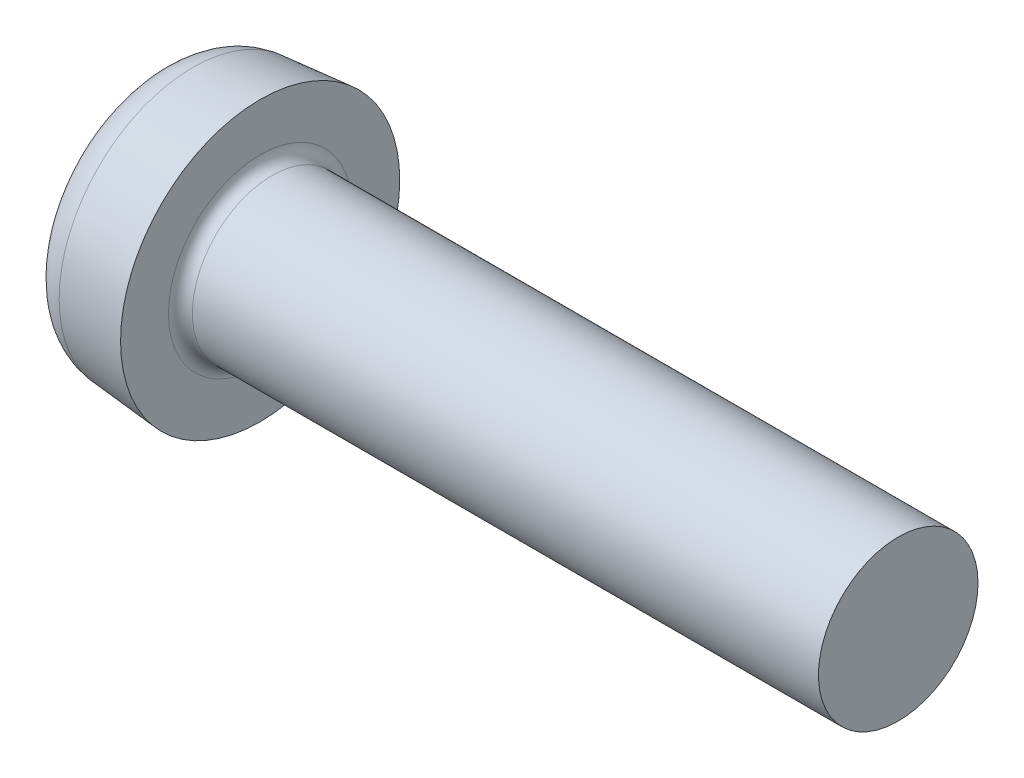
ISO-10303-21;
HEADER;
FILE_DESCRIPTION(('STEP AP214'),'2;1');
FILE_NAME('part.step','',(''),(''),'','','');
FILE_SCHEMA(('AUTOMOTIVE_DESIGN { 1 0 10303 214 1 1 1 1 }'));
ENDSEC;
DATA;
#1=APPLICATION_CONTEXT('core data for automotive mechanical design processes');
#2=APPLICATION_PROTOCOL_DEFINITION('international standard','automotive_design',2000,#1);
#3=PRODUCT_CONTEXT('',#1,'mechanical');
#4=PRODUCT('Part','Part','',(#3));
#5=PRODUCT_RELATED_PRODUCT_CATEGORY('part','',(#4));
#6=PRODUCT_DEFINITION_FORMATION('','',#4);
#7=PRODUCT_DEFINITION_CONTEXT('part definition',#1,'design');
#8=PRODUCT_DEFINITION('design','',#6,#7);
#9=PRODUCT_DEFINITION_SHAPE('','',#8);
#10=(LENGTH_UNIT() NAMED_UNIT(*) SI_UNIT(.MILLI.,.METRE.));
#11=(NAMED_UNIT(*) PLANE_ANGLE_UNIT() SI_UNIT($,.RADIAN.));
#12=(NAMED_UNIT(*) SI_UNIT($,.STERADIAN.) SOLID_ANGLE_UNIT());
#13=UNCERTAINTY_MEASURE_WITH_UNIT(LENGTH_MEASURE(1.E-05),#10,'distance_accuracy_value','');
#14=(GEOMETRIC_REPRESENTATION_CONTEXT(3) GLOBAL_UNCERTAINTY_ASSIGNED_CONTEXT((#13)) GLOBAL_UNIT_ASSIGNED_CONTEXT((#10,
#11,#12)) REPRESENTATION_CONTEXT('',''));
#15=CARTESIAN_POINT('',(0.,0.,0.));
#16=DIRECTION('',(0.,0.,1.));
#17=DIRECTION('',(1.,0.,0.));
#18=AXIS2_PLACEMENT_3D('',#15,#16,#17);
#19=CARTESIAN_POINT('',(0.,0.,0.));
#20=DIRECTION('',(-1.,0.,0.));
#21=DIRECTION('',(0.,0.,1.));
#22=AXIS2_PLACEMENT_3D('',#19,#20,#21);
#23=PLANE('',#22);
#24=CARTESIAN_POINT('',(0.,0.,0.));
#25=DIRECTION('',(-1.,0.,0.));
#26=DIRECTION('',(0.,0.,1.));
#27=AXIS2_PLACEMENT_3D('',#24,#25,#26);
#28=CIRCLE('',#27,2.35619830081517);
#29=CARTESIAN_POINT('',(0.,0.,2.35619830081517));
#30=VERTEX_POINT('',#29);
#31=EDGE_CURVE('E11',#30,#30,#28,.T.);
#32=ORIENTED_EDGE('',*,*,#31,.T.);
#33=EDGE_LOOP('',(#32));
#34=FACE_BOUND('',#33,.T.);
#35=DIRECTION('',(0.,0.,-1.));
#36=VECTOR('',#35,1.);
#37=CARTESIAN_POINT('',(0.,-0.41,0.41));
#38=LINE('',#37,#36);
#39=CARTESIAN_POINT('',(0.,-0.41,2.05));
#40=VERTEX_POINT('',#39);
#41=CARTESIAN_POINT('',(0.,-0.41,0.71));
#42=VERTEX_POINT('',#41);
#43=EDGE_CURVE('E231',#40,#42,#38,.T.);
#44=ORIENTED_EDGE('',*,*,#43,.T.);
#45=CARTESIAN_POINT('',(0.,-0.71,0.71));
#46=DIRECTION('',(-1.,0.,0.));
#47=DIRECTION('',(0.,0.,1.));
#48=AXIS2_PLACEMENT_3D('',#45,#46,#47);
#49=CIRCLE('',#48,0.3);
#50=CARTESIAN_POINT('',(0.,-0.71,0.41));
#51=VERTEX_POINT('',#50);
#52=EDGE_CURVE('E179',#42,#51,#49,.T.);
#53=ORIENTED_EDGE('',*,*,#52,.T.);
#54=DIRECTION('',(0.,-1.,0.));
#55=VECTOR('',#54,1.);
#56=CARTESIAN_POINT('',(0.,-0.41,0.41));
#57=LINE('',#56,#55);
#58=CARTESIAN_POINT('',(0.,-2.05,0.409999999999999));
#59=VERTEX_POINT('',#58);
#60=EDGE_CURVE('E228',#51,#59,#57,.T.);
#61=ORIENTED_EDGE('',*,*,#60,.T.);
#62=DIRECTION('',(0.,0.,-1.));
#63=VECTOR('',#62,1.);
#64=CARTESIAN_POINT('',(0.,-2.05,-0.41));
#65=LINE('',#64,#63);
#66=CARTESIAN_POINT('',(0.,-2.05,-0.41));
#67=VERTEX_POINT('',#66);
#68=EDGE_CURVE('E110',#59,#67,#65,.T.);
#69=ORIENTED_EDGE('',*,*,#68,.T.);
#70=DIRECTION('',(0.,1.,0.));
#71=VECTOR('',#70,1.);
#72=CARTESIAN_POINT('',(0.,-0.41,-0.41));
#73=LINE('',#72,#71);
#74=CARTESIAN_POINT('',(0.,-0.71,-0.41));
#75=VERTEX_POINT('',#74);
#76=EDGE_CURVE('E224',#67,#75,#73,.T.);
#77=ORIENTED_EDGE('',*,*,#76,.T.);
#78=CARTESIAN_POINT('',(0.,-0.71,-0.71));
#79=DIRECTION('',(-1.,0.,0.));
#80=DIRECTION('',(0.,0.,1.));
#81=AXIS2_PLACEMENT_3D('',#78,#79,#80);
#82=CIRCLE('',#81,0.3);
#83=CARTESIAN_POINT('',(0.,-0.41,-0.71));
#84=VERTEX_POINT('',#83);
#85=EDGE_CURVE('E182',#75,#84,#82,.T.);
#86=ORIENTED_EDGE('',*,*,#85,.T.);
#87=DIRECTION('',(0.,0.,-1.));
#88=VECTOR('',#87,1.);
#89=CARTESIAN_POINT('',(0.,-0.41,-0.41));
#90=LINE('',#89,#88);
#91=CARTESIAN_POINT('',(0.,-0.41,-2.05));
#92=VERTEX_POINT('',#91);
#93=EDGE_CURVE('E221',#84,#92,#90,.T.);
#94=ORIENTED_EDGE('',*,*,#93,.T.);
#95=DIRECTION('',(0.,1.,0.));
#96=VECTOR('',#95,1.);
#97=CARTESIAN_POINT('',(0.,0.41,-2.05));
#98=LINE('',#97,#96);
#99=CARTESIAN_POINT('',(0.,0.41,-2.05));
#100=VERTEX_POINT('',#99);
#101=EDGE_CURVE('E218',#92,#100,#98,.T.);
#102=ORIENTED_EDGE('',*,*,#101,.T.);
#103=DIRECTION('',(0.,0.,1.));
#104=VECTOR('',#103,1.);
#105=CARTESIAN_POINT('',(0.,0.41,-0.41));
#106=LINE('',#105,#104);
#107=CARTESIAN_POINT('',(0.,0.41,-0.71));
#108=VERTEX_POINT('',#107);
#109=EDGE_CURVE('E215',#100,#108,#106,.T.);
#110=ORIENTED_EDGE('',*,*,#109,.T.);
#111=CARTESIAN_POINT('',(0.,0.71,-0.71));
#112=DIRECTION('',(-1.,0.,0.));
#113=DIRECTION('',(0.,0.,1.));
#114=AXIS2_PLACEMENT_3D('',#111,#112,#113);
#115=CIRCLE('',#114,0.3);
#116=CARTESIAN_POINT('',(0.,0.71,-0.41));
#117=VERTEX_POINT('',#116);
#118=EDGE_CURVE('E188',#108,#117,#115,.T.);
#119=ORIENTED_EDGE('',*,*,#118,.T.);
#120=DIRECTION('',(0.,1.,0.));
#121=VECTOR('',#120,1.);
#122=CARTESIAN_POINT('',(0.,0.41,-0.41));
#123=LINE('',#122,#121);
#124=CARTESIAN_POINT('',(0.,2.05,-0.41));
#125=VERTEX_POINT('',#124);
#126=EDGE_CURVE('E212',#117,#125,#123,.T.);
#127=ORIENTED_EDGE('',*,*,#126,.T.);
#128=DIRECTION('',(0.,0.,1.));
#129=VECTOR('',#128,1.);
#130=CARTESIAN_POINT('',(0.,2.05,-0.41));
#131=LINE('',#130,#129);
#132=CARTESIAN_POINT('',(0.,2.05,0.41));
#133=VERTEX_POINT('',#132);
#134=EDGE_CURVE('E209',#125,#133,#131,.T.);
#135=ORIENTED_EDGE('',*,*,#134,.T.);
#136=DIRECTION('',(0.,-1.,0.));
#137=VECTOR('',#136,1.);
#138=CARTESIAN_POINT('',(0.,0.41,0.41));
#139=LINE('',#138,#137);
#140=CARTESIAN_POINT('',(0.,0.71,0.41));
#141=VERTEX_POINT('',#140);
#142=EDGE_CURVE('E206',#133,#141,#139,.T.);
#143=ORIENTED_EDGE('',*,*,#142,.T.);
#144=CARTESIAN_POINT('',(0.,0.71,0.71));
#145=DIRECTION('',(-1.,0.,0.));
#146=DIRECTION('',(0.,0.,1.));
#147=AXIS2_PLACEMENT_3D('',#144,#145,#146);
#148=CIRCLE('',#147,0.3);
#149=CARTESIAN_POINT('',(0.,0.41,0.71));
#150=VERTEX_POINT('',#149);
#151=EDGE_CURVE('E185',#141,#150,#148,.T.);
#152=ORIENTED_EDGE('',*,*,#151,.T.);
#153=DIRECTION('',(0.,0.,1.));
#154=VECTOR('',#153,1.);
#155=CARTESIAN_POINT('',(0.,0.41,0.41));
#156=LINE('',#155,#154);
#157=CARTESIAN_POINT('',(0.,0.409999999999999,2.05));
#158=VERTEX_POINT('',#157);
#159=EDGE_CURVE('E237',#150,#158,#156,.T.);
#160=ORIENTED_EDGE('',*,*,#159,.T.);
#161=DIRECTION('',(0.,-1.,0.));
#162=VECTOR('',#161,1.);
#163=CARTESIAN_POINT('',(0.,0.409999999999999,2.05));
#164=LINE('',#163,#162);
#165=EDGE_CURVE('E234',#158,#40,#164,.T.);
#166=ORIENTED_EDGE('',*,*,#165,.T.);
#167=EDGE_LOOP('',(#44,#53,#61,#69,#77,#86,#94,#102,#110,#119,#127,#135,#143,#152,#160,#166));
#168=FACE_BOUND('',#167,.T.);
#169=ADVANCED_FACE('F38',(#34,#168),#23,.T.);
#170=CARTESIAN_POINT('',(18.6,2.,0.));
#171=DIRECTION('',(1.,0.,0.));
#172=DIRECTION('',(0.,0.,-1.));
#173=AXIS2_PLACEMENT_3D('',#170,#171,#172);
#174=PLANE('',#173);
#175=CARTESIAN_POINT('',(18.6,0.,0.));
#176=DIRECTION('',(1.,0.,0.));
#177=DIRECTION('',(0.,0.,-1.));
#178=AXIS2_PLACEMENT_3D('',#175,#176,#177);
#179=CIRCLE('',#178,2.);
#180=CARTESIAN_POINT('',(18.6,0.,-2.));
#181=VERTEX_POINT('',#180);
#182=EDGE_CURVE('E194',#181,#181,#179,.T.);
#183=ORIENTED_EDGE('',*,*,#182,.T.);
#184=EDGE_LOOP('',(#183));
#185=FACE_BOUND('',#184,.T.);
#186=ADVANCED_FACE('F356',(#185),#174,.T.);
#187=CARTESIAN_POINT('',(4.51581291088132,0.,0.));
#188=DIRECTION('',(1.,0.,0.));
#189=DIRECTION('',(0.,0.,-1.));
#190=AXIS2_PLACEMENT_3D('',#187,#188,#189);
#191=CYLINDRICAL_SURFACE('',#190,2.);
#192=CARTESIAN_POINT('',(2.9,0.,0.));
#193=DIRECTION('',(1.,0.,0.));
#194=DIRECTION('',(0.,0.,-1.));
#195=AXIS2_PLACEMENT_3D('',#192,#193,#194);
#196=CIRCLE('',#195,2.);
#197=CARTESIAN_POINT('',(2.9,0.,-2.));
#198=VERTEX_POINT('',#197);
#199=EDGE_CURVE('E197',#198,#198,#196,.T.);
#200=ORIENTED_EDGE('',*,*,#199,.T.);
#201=EDGE_LOOP('',(#200));
#202=FACE_BOUND('',#201,.T.);
#203=ORIENTED_EDGE('',*,*,#182,.F.);
#204=EDGE_LOOP('',(#203));
#205=FACE_BOUND('',#204,.T.);
#206=ADVANCED_FACE('F362',(#202,#205),#191,.T.);
#207=CARTESIAN_POINT('',(2.9,0.,0.));
#208=DIRECTION('',(1.,0.,0.));
#209=DIRECTION('',(0.,0.,-1.));
#210=AXIS2_PLACEMENT_3D('',#207,#208,#209);
#211=TOROIDAL_SURFACE('',#210,2.3,0.3);
#212=CARTESIAN_POINT('',(2.6,0.,0.));
#213=DIRECTION('',(1.,0.,0.));
#214=DIRECTION('',(0.,0.,-1.));
#215=AXIS2_PLACEMENT_3D('',#212,#213,#214);
#216=CIRCLE('',#215,2.3);
#217=CARTESIAN_POINT('',(2.6,0.,-2.3));
#218=VERTEX_POINT('',#217);
#219=EDGE_CURVE('E200',#218,#218,#216,.T.);
#220=ORIENTED_EDGE('',*,*,#219,.T.);
#221=EDGE_LOOP('',(#220));
#222=FACE_BOUND('',#221,.T.);
#223=ORIENTED_EDGE('',*,*,#199,.F.);
#224=EDGE_LOOP('',(#223));
#225=FACE_BOUND('',#224,.T.);
#226=ADVANCED_FACE('F373',(#222,#225),#211,.F.);
#227=CARTESIAN_POINT('',(2.6,2.3,0.));
#228=DIRECTION('',(1.,0.,0.));
#229=DIRECTION('',(0.,0.,-1.));
#230=AXIS2_PLACEMENT_3D('',#227,#228,#229);
#231=PLANE('',#230);
#232=CARTESIAN_POINT('',(2.6,0.,0.));
#233=DIRECTION('',(1.,0.,0.));
#234=DIRECTION('',(0.,0.,-1.));
#235=AXIS2_PLACEMENT_3D('',#232,#233,#234);
#236=CIRCLE('',#235,3.5);
#237=CARTESIAN_POINT('',(2.6,0.,-3.5));
#238=VERTEX_POINT('',#237);
#239=EDGE_CURVE('E145',#238,#238,#236,.T.);
#240=ORIENTED_EDGE('',*,*,#239,.T.);
#241=EDGE_LOOP('',(#240));
#242=FACE_BOUND('',#241,.T.);
#243=ORIENTED_EDGE('',*,*,#219,.F.);
#244=EDGE_LOOP('',(#243));
#245=FACE_BOUND('',#244,.T.);
#246=ADVANCED_FACE('F369',(#242,#245),#231,.T.);
#247=CARTESIAN_POINT('',(2.6,0.,0.));
#248=DIRECTION('',(1.,0.,0.));
#249=DIRECTION('',(0.,0.,-1.));
#250=AXIS2_PLACEMENT_3D('',#247,#248,#249);
#251=CONICAL_SURFACE('',#250,3.5,0.08726646259972);
#252=CARTESIAN_POINT('',(0.91284425725234,0.,0.));
#253=DIRECTION('',(-1.,0.,0.));
#254=DIRECTION('',(0.,0.,1.));
#255=AXIS2_PLACEMENT_3D('',#252,#253,#254);
#256=CIRCLE('',#255,3.35239299890691);
#257=CARTESIAN_POINT('',(0.91284425725234,0.,3.35239299890691));
#258=VERTEX_POINT('',#257);
#259=EDGE_CURVE('E48',#258,#258,#256,.F.);
#260=ORIENTED_EDGE('',*,*,#259,.T.);
#261=EDGE_LOOP('',(#260));
#262=FACE_BOUND('',#261,.T.);
#263=ORIENTED_EDGE('',*,*,#239,.F.);
#264=EDGE_LOOP('',(#263));
#265=FACE_BOUND('',#264,.T.);
#266=ADVANCED_FACE('F366',(#262,#265),#251,.T.);
#267=CARTESIAN_POINT('',(2.6,0.41,0.41));
#268=DIRECTION('',(0.,-1.,0.));
#269=DIRECTION('',(0.,0.,-1.));
#270=AXIS2_PLACEMENT_3D('',#267,#268,#269);
#271=PLANE('',#270);
#272=ORIENTED_EDGE('',*,*,#159,.F.);
#273=DIRECTION('',(-1.,0.,0.));
#274=VECTOR('',#273,1.);
#275=CARTESIAN_POINT('',(2.6,0.41,0.71));
#276=LINE('',#275,#274);
#277=CARTESIAN_POINT('',(2.6,0.41,0.71));
#278=VERTEX_POINT('',#277);
#279=EDGE_CURVE('E166',#150,#278,#276,.F.);
#280=ORIENTED_EDGE('',*,*,#279,.T.);
#281=DIRECTION('',(0.,0.,1.));
#282=VECTOR('',#281,1.);
#283=CARTESIAN_POINT('',(2.6,0.41,0.41));
#284=LINE('',#283,#282);
#285=CARTESIAN_POINT('',(2.6,0.41,1.10367739090787));
#286=VERTEX_POINT('',#285);
#287=EDGE_CURVE('E148',#278,#286,#284,.T.);
#288=ORIENTED_EDGE('',*,*,#287,.T.);
#289=DIRECTION('',(-0.939692620785908,0.,0.342020143325669));
#290=VECTOR('',#289,1.);
#291=CARTESIAN_POINT('',(0.,0.409999999999999,2.05));
#292=LINE('',#291,#290);
#293=EDGE_CURVE('E142',#286,#158,#292,.T.);
#294=ORIENTED_EDGE('',*,*,#293,.T.);
#295=EDGE_LOOP('',(#272,#280,#288,#294));
#296=FACE_BOUND('',#295,.T.);
#297=ADVANCED_FACE('F251',(#296),#271,.T.);
#298=CARTESIAN_POINT('',(0.,0.409999999999999,2.05));
#299=DIRECTION('',(-0.342020143325669,0.,-0.939692620785908));
#300=DIRECTION('',(-0.939692620785908,0.,0.342020143325669));
#301=AXIS2_PLACEMENT_3D('',#298,#299,#300);
#302=PLANE('',#301);
#303=ORIENTED_EDGE('',*,*,#165,.F.);
#304=ORIENTED_EDGE('',*,*,#293,.F.);
#305=DIRECTION('',(0.,-1.,0.));
#306=VECTOR('',#305,1.);
#307=CARTESIAN_POINT('',(2.6,0.41,1.10367739090787));
#308=LINE('',#307,#306);
#309=CARTESIAN_POINT('',(2.6,-0.41,1.10367739090787));
#310=VERTEX_POINT('',#309);
#311=EDGE_CURVE('E146',#286,#310,#308,.T.);
#312=ORIENTED_EDGE('',*,*,#311,.T.);
#313=DIRECTION('',(-0.939692620785908,0.,0.342020143325669));
#314=VECTOR('',#313,1.);
#315=CARTESIAN_POINT('',(2.82294361599763,-0.41,1.02253255076506));
#316=LINE('',#315,#314);
#317=EDGE_CURVE('E111',#310,#40,#316,.T.);
#318=ORIENTED_EDGE('',*,*,#317,.T.);
#319=EDGE_LOOP('',(#303,#304,#312,#318));
#320=FACE_BOUND('',#319,.T.);
#321=ADVANCED_FACE('F260',(#320),#302,.T.);
#322=CARTESIAN_POINT('',(2.6,-0.41,0.41));
#323=DIRECTION('',(0.,1.,0.));
#324=DIRECTION('',(0.,0.,1.));
#325=AXIS2_PLACEMENT_3D('',#322,#323,#324);
#326=PLANE('',#325);
#327=DIRECTION('',(0.,0.,-1.));
#328=VECTOR('',#327,1.);
#329=CARTESIAN_POINT('',(2.6,-0.41,0.41));
#330=LINE('',#329,#328);
#331=CARTESIAN_POINT('',(2.6,-0.41,0.71));
#332=VERTEX_POINT('',#331);
#333=EDGE_CURVE('E106',#310,#332,#330,.T.);
#334=ORIENTED_EDGE('',*,*,#333,.T.);
#335=DIRECTION('',(-1.,0.,0.));
#336=VECTOR('',#335,1.);
#337=CARTESIAN_POINT('',(2.6,-0.41,0.71));
#338=LINE('',#337,#336);
#339=EDGE_CURVE('E191',#332,#42,#338,.T.);
#340=ORIENTED_EDGE('',*,*,#339,.T.);
#341=ORIENTED_EDGE('',*,*,#43,.F.);
#342=ORIENTED_EDGE('',*,*,#317,.F.);
#343=EDGE_LOOP('',(#334,#340,#341,#342));
#344=FACE_BOUND('',#343,.T.);
#345=ADVANCED_FACE('F345',(#344),#326,.T.);
#346=CARTESIAN_POINT('',(2.6,-0.41,0.41));
#347=DIRECTION('',(0.,0.,-1.));
#348=DIRECTION('',(0.,1.,0.));
#349=AXIS2_PLACEMENT_3D('',#346,#347,#348);
#350=PLANE('',#349);
#351=ORIENTED_EDGE('',*,*,#60,.F.);
#352=DIRECTION('',(-1.,0.,0.));
#353=VECTOR('',#352,1.);
#354=CARTESIAN_POINT('',(2.6,-0.71,0.41));
#355=LINE('',#354,#353);
#356=CARTESIAN_POINT('',(2.6,-0.71,0.41));
#357=VERTEX_POINT('',#356);
#358=EDGE_CURVE('E102',#51,#357,#355,.F.);
#359=ORIENTED_EDGE('',*,*,#358,.T.);
#360=DIRECTION('',(0.,-1.,0.));
#361=VECTOR('',#360,1.);
#362=CARTESIAN_POINT('',(2.6,-0.41,0.41));
#363=LINE('',#362,#361);
#364=CARTESIAN_POINT('',(2.6,-1.10367739090787,0.409999999999999));
#365=VERTEX_POINT('',#364);
#366=EDGE_CURVE('E95',#357,#365,#363,.T.);
#367=ORIENTED_EDGE('',*,*,#366,.T.);
#368=DIRECTION('',(-0.939692620785908,-0.342020143325669,0.));
#369=VECTOR('',#368,1.);
#370=CARTESIAN_POINT('',(0.,-2.05,0.409999999999999));
#371=LINE('',#370,#369);
#372=EDGE_CURVE('E42',#365,#59,#371,.T.);
#373=ORIENTED_EDGE('',*,*,#372,.T.);
#374=EDGE_LOOP('',(#351,#359,#367,#373));
#375=FACE_BOUND('',#374,.T.);
#376=ADVANCED_FACE('F97',(#375),#350,.T.);
#377=CARTESIAN_POINT('',(0.,-2.05,-0.41));
#378=DIRECTION('',(-0.342020143325669,0.939692620785908,0.));
#379=DIRECTION('',(-0.939692620785908,-0.342020143325669,0.));
#380=AXIS2_PLACEMENT_3D('',#377,#378,#379);
#381=PLANE('',#380);
#382=ORIENTED_EDGE('',*,*,#68,.F.);
#383=ORIENTED_EDGE('',*,*,#372,.F.);
#384=DIRECTION('',(0.,0.,-1.));
#385=VECTOR('',#384,1.);
#386=CARTESIAN_POINT('',(2.6,-1.10367739090787,-0.41));
#387=LINE('',#386,#385);
#388=CARTESIAN_POINT('',(2.6,-1.10367739090787,-0.41));
#389=VERTEX_POINT('',#388);
#390=EDGE_CURVE('E88',#365,#389,#387,.T.);
#391=ORIENTED_EDGE('',*,*,#390,.T.);
#392=DIRECTION('',(-0.939692620785908,-0.342020143325669,0.));
#393=VECTOR('',#392,1.);
#394=CARTESIAN_POINT('',(2.82294361599763,-1.02253255076506,-0.41));
#395=LINE('',#394,#393);
#396=EDGE_CURVE('E112',#389,#67,#395,.T.);
#397=ORIENTED_EDGE('',*,*,#396,.T.);
#398=EDGE_LOOP('',(#382,#383,#391,#397));
#399=FACE_BOUND('',#398,.T.);
#400=ADVANCED_FACE('F108',(#399),#381,.T.);
#401=CARTESIAN_POINT('',(2.6,-0.41,-0.41));
#402=DIRECTION('',(0.,0.,1.));
#403=DIRECTION('',(1.,0.,0.));
#404=AXIS2_PLACEMENT_3D('',#401,#402,#403);
#405=PLANE('',#404);
#406=DIRECTION('',(0.,1.,0.));
#407=VECTOR('',#406,1.);
#408=CARTESIAN_POINT('',(2.6,-0.41,-0.41));
#409=LINE('',#408,#407);
#410=CARTESIAN_POINT('',(2.6,-0.71,-0.41));
#411=VERTEX_POINT('',#410);
#412=EDGE_CURVE('E118',#389,#411,#409,.T.);
#413=ORIENTED_EDGE('',*,*,#412,.T.);
#414=DIRECTION('',(-1.,0.,0.));
#415=VECTOR('',#414,1.);
#416=CARTESIAN_POINT('',(2.6,-0.71,-0.41));
#417=LINE('',#416,#415);
#418=EDGE_CURVE('E175',#411,#75,#417,.T.);
#419=ORIENTED_EDGE('',*,*,#418,.T.);
#420=ORIENTED_EDGE('',*,*,#76,.F.);
#421=ORIENTED_EDGE('',*,*,#396,.F.);
#422=EDGE_LOOP('',(#413,#419,#420,#421));
#423=FACE_BOUND('',#422,.T.);
#424=ADVANCED_FACE('F340',(#423),#405,.T.);
#425=CARTESIAN_POINT('',(2.6,-0.41,-0.41));
#426=DIRECTION('',(0.,1.,0.));
#427=DIRECTION('',(0.,0.,1.));
#428=AXIS2_PLACEMENT_3D('',#425,#426,#427);
#429=PLANE('',#428);
#430=ORIENTED_EDGE('',*,*,#93,.F.);
#431=DIRECTION('',(-1.,0.,0.));
#432=VECTOR('',#431,1.);
#433=CARTESIAN_POINT('',(2.6,-0.41,-0.71));
#434=LINE('',#433,#432);
#435=CARTESIAN_POINT('',(2.6,-0.41,-0.71));
#436=VERTEX_POINT('',#435);
#437=EDGE_CURVE('E172',#84,#436,#434,.F.);
#438=ORIENTED_EDGE('',*,*,#437,.T.);
#439=DIRECTION('',(0.,0.,-1.));
#440=VECTOR('',#439,1.);
#441=CARTESIAN_POINT('',(2.6,-0.41,-0.41));
#442=LINE('',#441,#440);
#443=CARTESIAN_POINT('',(2.6,-0.41,-1.10367739090787));
#444=VERTEX_POINT('',#443);
#445=EDGE_CURVE('E119',#436,#444,#442,.T.);
#446=ORIENTED_EDGE('',*,*,#445,.T.);
#447=DIRECTION('',(-0.939692620785908,0.,-0.342020143325669));
#448=VECTOR('',#447,1.);
#449=CARTESIAN_POINT('',(0.,-0.41,-2.05));
#450=LINE('',#449,#448);
#451=EDGE_CURVE('E123',#444,#92,#450,.T.);
#452=ORIENTED_EDGE('',*,*,#451,.T.);
#453=EDGE_LOOP('',(#430,#438,#446,#452));
#454=FACE_BOUND('',#453,.T.);
#455=ADVANCED_FACE('F395',(#454),#429,.T.);
#456=CARTESIAN_POINT('',(0.,0.41,-2.05));
#457=DIRECTION('',(-0.342020143325669,0.,0.939692620785908));
#458=DIRECTION('',(0.939692620785908,0.,0.342020143325669));
#459=AXIS2_PLACEMENT_3D('',#456,#457,#458);
#460=PLANE('',#459);
#461=ORIENTED_EDGE('',*,*,#101,.F.);
#462=ORIENTED_EDGE('',*,*,#451,.F.);
#463=DIRECTION('',(0.,1.,0.));
#464=VECTOR('',#463,1.);
#465=CARTESIAN_POINT('',(2.6,0.41,-1.10367739090787));
#466=LINE('',#465,#464);
#467=CARTESIAN_POINT('',(2.6,0.41,-1.10367739090787));
#468=VERTEX_POINT('',#467);
#469=EDGE_CURVE('E127',#444,#468,#466,.T.);
#470=ORIENTED_EDGE('',*,*,#469,.T.);
#471=DIRECTION('',(-0.939692620785908,0.,-0.342020143325669));
#472=VECTOR('',#471,1.);
#473=CARTESIAN_POINT('',(2.82294361599763,0.41,-1.02253255076506));
#474=LINE('',#473,#472);
#475=EDGE_CURVE('E126',#468,#100,#474,.T.);
#476=ORIENTED_EDGE('',*,*,#475,.T.);
#477=EDGE_LOOP('',(#461,#462,#470,#476));
#478=FACE_BOUND('',#477,.T.);
#479=ADVANCED_FACE('F329',(#478),#460,.T.);
#480=CARTESIAN_POINT('',(2.6,0.41,-0.41));
#481=DIRECTION('',(0.,-1.,0.));
#482=DIRECTION('',(0.,0.,-1.));
#483=AXIS2_PLACEMENT_3D('',#480,#481,#482);
#484=PLANE('',#483);
#485=DIRECTION('',(0.,0.,1.));
#486=VECTOR('',#485,1.);
#487=CARTESIAN_POINT('',(2.6,0.41,-0.41));
#488=LINE('',#487,#486);
#489=CARTESIAN_POINT('',(2.6,0.41,-0.71));
#490=VERTEX_POINT('',#489);
#491=EDGE_CURVE('E129',#468,#490,#488,.T.);
#492=ORIENTED_EDGE('',*,*,#491,.T.);
#493=DIRECTION('',(-1.,0.,0.));
#494=VECTOR('',#493,1.);
#495=CARTESIAN_POINT('',(2.6,0.41,-0.71));
#496=LINE('',#495,#494);
#497=EDGE_CURVE('E163',#490,#108,#496,.T.);
#498=ORIENTED_EDGE('',*,*,#497,.T.);
#499=ORIENTED_EDGE('',*,*,#109,.F.);
#500=ORIENTED_EDGE('',*,*,#475,.F.);
#501=EDGE_LOOP('',(#492,#498,#499,#500));
#502=FACE_BOUND('',#501,.T.);
#503=ADVANCED_FACE('F323',(#502),#484,.T.);
#504=CARTESIAN_POINT('',(2.6,0.41,-0.41));
#505=DIRECTION('',(0.,0.,1.));
#506=DIRECTION('',(1.,0.,0.));
#507=AXIS2_PLACEMENT_3D('',#504,#505,#506);
#508=PLANE('',#507);
#509=ORIENTED_EDGE('',*,*,#126,.F.);
#510=DIRECTION('',(-1.,0.,0.));
#511=VECTOR('',#510,1.);
#512=CARTESIAN_POINT('',(2.6,0.71,-0.41));
#513=LINE('',#512,#511);
#514=CARTESIAN_POINT('',(2.6,0.71,-0.41));
#515=VERTEX_POINT('',#514);
#516=EDGE_CURVE('E57',#117,#515,#513,.F.);
#517=ORIENTED_EDGE('',*,*,#516,.T.);
#518=DIRECTION('',(0.,1.,0.));
#519=VECTOR('',#518,1.);
#520=CARTESIAN_POINT('',(2.6,0.41,-0.41));
#521=LINE('',#520,#519);
#522=CARTESIAN_POINT('',(2.6,1.10367739090787,-0.41));
#523=VERTEX_POINT('',#522);
#524=EDGE_CURVE('E139',#515,#523,#521,.T.);
#525=ORIENTED_EDGE('',*,*,#524,.T.);
#526=DIRECTION('',(-0.939692620785908,0.342020143325669,0.));
#527=VECTOR('',#526,1.);
#528=CARTESIAN_POINT('',(0.,2.05,-0.41));
#529=LINE('',#528,#527);
#530=EDGE_CURVE('E132',#523,#125,#529,.T.);
#531=ORIENTED_EDGE('',*,*,#530,.T.);
#532=EDGE_LOOP('',(#509,#517,#525,#531));
#533=FACE_BOUND('',#532,.T.);
#534=ADVANCED_FACE('F400',(#533),#508,.T.);
#535=CARTESIAN_POINT('',(0.,2.05,-0.41));
#536=DIRECTION('',(-0.342020143325669,-0.939692620785908,0.));
#537=DIRECTION('',(0.939692620785908,-0.342020143325669,0.));
#538=AXIS2_PLACEMENT_3D('',#535,#536,#537);
#539=PLANE('',#538);
#540=ORIENTED_EDGE('',*,*,#134,.F.);
#541=ORIENTED_EDGE('',*,*,#530,.F.);
#542=DIRECTION('',(0.,0.,1.));
#543=VECTOR('',#542,1.);
#544=CARTESIAN_POINT('',(2.6,1.10367739090787,-0.41));
#545=LINE('',#544,#543);
#546=CARTESIAN_POINT('',(2.6,1.10367739090787,0.41));
#547=VERTEX_POINT('',#546);
#548=EDGE_CURVE('E136',#523,#547,#545,.T.);
#549=ORIENTED_EDGE('',*,*,#548,.T.);
#550=DIRECTION('',(-0.939692620785908,0.342020143325669,0.));
#551=VECTOR('',#550,1.);
#552=CARTESIAN_POINT('',(2.82294361599763,1.02253255076506,0.41));
#553=LINE('',#552,#551);
#554=EDGE_CURVE('E135',#547,#133,#553,.T.);
#555=ORIENTED_EDGE('',*,*,#554,.T.);
#556=EDGE_LOOP('',(#540,#541,#549,#555));
#557=FACE_BOUND('',#556,.T.);
#558=ADVANCED_FACE('F40',(#557),#539,.T.);
#559=CARTESIAN_POINT('',(2.6,0.41,0.41));
#560=DIRECTION('',(0.,0.,-1.));
#561=DIRECTION('',(0.,1.,0.));
#562=AXIS2_PLACEMENT_3D('',#559,#560,#561);
#563=PLANE('',#562);
#564=DIRECTION('',(0.,-1.,0.));
#565=VECTOR('',#564,1.);
#566=CARTESIAN_POINT('',(2.6,0.41,0.41));
#567=LINE('',#566,#565);
#568=CARTESIAN_POINT('',(2.6,0.71,0.41));
#569=VERTEX_POINT('',#568);
#570=EDGE_CURVE('E138',#547,#569,#567,.T.);
#571=ORIENTED_EDGE('',*,*,#570,.T.);
#572=DIRECTION('',(-1.,0.,0.));
#573=VECTOR('',#572,1.);
#574=CARTESIAN_POINT('',(2.6,0.71,0.41));
#575=LINE('',#574,#573);
#576=EDGE_CURVE('E169',#569,#141,#575,.T.);
#577=ORIENTED_EDGE('',*,*,#576,.T.);
#578=ORIENTED_EDGE('',*,*,#142,.F.);
#579=ORIENTED_EDGE('',*,*,#554,.F.);
#580=EDGE_LOOP('',(#571,#577,#578,#579));
#581=FACE_BOUND('',#580,.T.);
#582=ADVANCED_FACE('F310',(#581),#563,.T.);
#583=CARTESIAN_POINT('',(2.6,0.41,0.41));
#584=DIRECTION('',(1.,0.,0.));
#585=DIRECTION('',(0.,0.,-1.));
#586=AXIS2_PLACEMENT_3D('',#583,#584,#585);
#587=PLANE('',#586);
#588=ORIENTED_EDGE('',*,*,#287,.F.);
#589=CARTESIAN_POINT('',(2.6,0.71,0.71));
#590=DIRECTION('',(1.,0.,0.));
#591=DIRECTION('',(0.,0.,-1.));
#592=AXIS2_PLACEMENT_3D('',#589,#590,#591);
#593=CIRCLE('',#592,0.3);
#594=EDGE_CURVE('E155',#278,#569,#593,.T.);
#595=ORIENTED_EDGE('',*,*,#594,.T.);
#596=ORIENTED_EDGE('',*,*,#570,.F.);
#597=ORIENTED_EDGE('',*,*,#548,.F.);
#598=ORIENTED_EDGE('',*,*,#524,.F.);
#599=CARTESIAN_POINT('',(2.6,0.71,-0.71));
#600=DIRECTION('',(1.,0.,0.));
#601=DIRECTION('',(0.,0.,-1.));
#602=AXIS2_PLACEMENT_3D('',#599,#600,#601);
#603=CIRCLE('',#602,0.3);
#604=EDGE_CURVE('E153',#515,#490,#603,.T.);
#605=ORIENTED_EDGE('',*,*,#604,.T.);
#606=ORIENTED_EDGE('',*,*,#491,.F.);
#607=ORIENTED_EDGE('',*,*,#469,.F.);
#608=ORIENTED_EDGE('',*,*,#445,.F.);
#609=CARTESIAN_POINT('',(2.6,-0.71,-0.71));
#610=DIRECTION('',(1.,0.,0.));
#611=DIRECTION('',(0.,0.,-1.));
#612=AXIS2_PLACEMENT_3D('',#609,#610,#611);
#613=CIRCLE('',#612,0.3);
#614=EDGE_CURVE('E158',#436,#411,#613,.T.);
#615=ORIENTED_EDGE('',*,*,#614,.T.);
#616=ORIENTED_EDGE('',*,*,#412,.F.);
#617=ORIENTED_EDGE('',*,*,#390,.F.);
#618=ORIENTED_EDGE('',*,*,#366,.F.);
#619=CARTESIAN_POINT('',(2.6,-0.71,0.71));
#620=DIRECTION('',(1.,0.,0.));
#621=DIRECTION('',(0.,0.,-1.));
#622=AXIS2_PLACEMENT_3D('',#619,#620,#621);
#623=CIRCLE('',#622,0.3);
#624=EDGE_CURVE('E160',#357,#332,#623,.T.);
#625=ORIENTED_EDGE('',*,*,#624,.T.);
#626=ORIENTED_EDGE('',*,*,#333,.F.);
#627=ORIENTED_EDGE('',*,*,#311,.F.);
#628=EDGE_LOOP('',(#588,#595,#596,#597,#598,#605,#606,#607,#608,#615,#616,#617,#618,#625,#626,#627));
#629=FACE_BOUND('',#628,.T.);
#630=ADVANCED_FACE('F115',(#629),#587,.F.);
#631=CARTESIAN_POINT('',(2.6,-0.71,0.71));
#632=DIRECTION('',(-1.,0.,0.));
#633=DIRECTION('',(0.,0.,1.));
#634=AXIS2_PLACEMENT_3D('',#631,#632,#633);
#635=CYLINDRICAL_SURFACE('',#634,0.3);
#636=ORIENTED_EDGE('',*,*,#624,.F.);
#637=ORIENTED_EDGE('',*,*,#358,.F.);
#638=ORIENTED_EDGE('',*,*,#52,.F.);
#639=ORIENTED_EDGE('',*,*,#339,.F.);
#640=EDGE_LOOP('',(#636,#637,#638,#639));
#641=FACE_BOUND('',#640,.T.);
#642=ADVANCED_FACE('F342',(#641),#635,.T.);
#643=CARTESIAN_POINT('',(2.6,-0.71,-0.71));
#644=DIRECTION('',(-1.,0.,0.));
#645=DIRECTION('',(0.,0.,1.));
#646=AXIS2_PLACEMENT_3D('',#643,#644,#645);
#647=CYLINDRICAL_SURFACE('',#646,0.3);
#648=ORIENTED_EDGE('',*,*,#614,.F.);
#649=ORIENTED_EDGE('',*,*,#437,.F.);
#650=ORIENTED_EDGE('',*,*,#85,.F.);
#651=ORIENTED_EDGE('',*,*,#418,.F.);
#652=EDGE_LOOP('',(#648,#649,#650,#651));
#653=FACE_BOUND('',#652,.T.);
#654=ADVANCED_FACE('F337',(#653),#647,.T.);
#655=CARTESIAN_POINT('',(2.6,0.71,0.71));
#656=DIRECTION('',(-1.,0.,0.));
#657=DIRECTION('',(0.,0.,1.));
#658=AXIS2_PLACEMENT_3D('',#655,#656,#657);
#659=CYLINDRICAL_SURFACE('',#658,0.3);
#660=ORIENTED_EDGE('',*,*,#594,.F.);
#661=ORIENTED_EDGE('',*,*,#279,.F.);
#662=ORIENTED_EDGE('',*,*,#151,.F.);
#663=ORIENTED_EDGE('',*,*,#576,.F.);
#664=EDGE_LOOP('',(#660,#661,#662,#663));
#665=FACE_BOUND('',#664,.T.);
#666=ADVANCED_FACE('F312',(#665),#659,.T.);
#667=CARTESIAN_POINT('',(2.6,0.71,-0.71));
#668=DIRECTION('',(-1.,0.,0.));
#669=DIRECTION('',(0.,0.,1.));
#670=AXIS2_PLACEMENT_3D('',#667,#668,#669);
#671=CYLINDRICAL_SURFACE('',#670,0.3);
#672=ORIENTED_EDGE('',*,*,#604,.F.);
#673=ORIENTED_EDGE('',*,*,#516,.F.);
#674=ORIENTED_EDGE('',*,*,#118,.F.);
#675=ORIENTED_EDGE('',*,*,#497,.F.);
#676=EDGE_LOOP('',(#672,#673,#674,#675));
#677=FACE_BOUND('',#676,.T.);
#678=ADVANCED_FACE('F320',(#677),#671,.T.);
#679=CARTESIAN_POINT('',(1.,0.,0.));
#680=DIRECTION('',(-1.,0.,0.));
#681=DIRECTION('',(0.,0.,1.));
#682=AXIS2_PLACEMENT_3D('',#679,#680,#681);
#683=TOROIDAL_SURFACE('',#682,2.35619830081517,1.);
#684=ORIENTED_EDGE('',*,*,#31,.F.);
#685=EDGE_LOOP('',(#684));
#686=FACE_BOUND('',#685,.T.);
#687=ORIENTED_EDGE('',*,*,#259,.F.);
#688=EDGE_LOOP('',(#687));
#689=FACE_BOUND('',#688,.T.);
#690=ADVANCED_FACE('F389',(#686,#689),#683,.T.);
#691=CLOSED_SHELL('',(#169,#186,#206,#226,#246,#266,#297,#321,#345,#376,#400,#424,#455,#479,
#503,#534,#558,#582,#630,#642,#654,#666,#678,#690));
#692=MANIFOLD_SOLID_BREP('B2',#691);
#693=ADVANCED_BREP_SHAPE_REPRESENTATION('',(#18,#692),#14);
#694=SHAPE_DEFINITION_REPRESENTATION(#9,#693);
ENDSEC;
END-ISO-10303-21;
